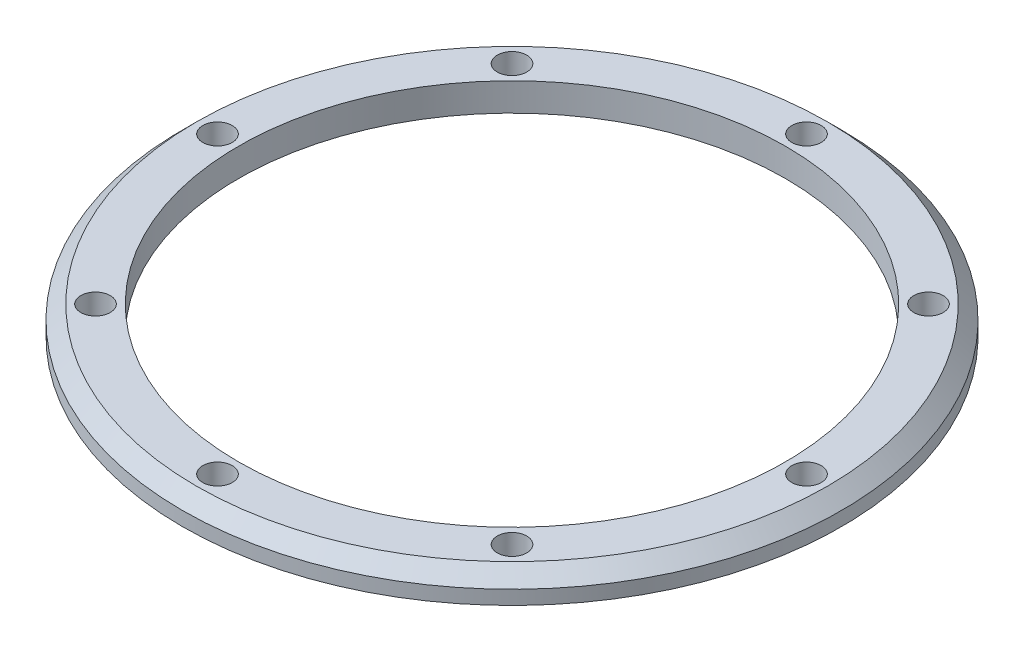
ISO-10303-21;
HEADER;
FILE_DESCRIPTION(('STEP AP214'),'2;1');
FILE_NAME('part.step','',(''),(''),'','','');
FILE_SCHEMA(('AUTOMOTIVE_DESIGN { 1 0 10303 214 1 1 1 1 }'));
ENDSEC;
DATA;
#1=APPLICATION_CONTEXT('core data for automotive mechanical design processes');
#2=APPLICATION_PROTOCOL_DEFINITION('international standard','automotive_design',2000,#1);
#3=PRODUCT_CONTEXT('',#1,'mechanical');
#4=PRODUCT('Part','Part','',(#3));
#5=PRODUCT_RELATED_PRODUCT_CATEGORY('part','',(#4));
#6=PRODUCT_DEFINITION_FORMATION('','',#4);
#7=PRODUCT_DEFINITION_CONTEXT('part definition',#1,'design');
#8=PRODUCT_DEFINITION('design','',#6,#7);
#9=PRODUCT_DEFINITION_SHAPE('','',#8);
#10=(LENGTH_UNIT() NAMED_UNIT(*) SI_UNIT(.MILLI.,.METRE.));
#11=(NAMED_UNIT(*) PLANE_ANGLE_UNIT() SI_UNIT($,.RADIAN.));
#12=(NAMED_UNIT(*) SI_UNIT($,.STERADIAN.) SOLID_ANGLE_UNIT());
#13=UNCERTAINTY_MEASURE_WITH_UNIT(LENGTH_MEASURE(1.E-05),#10,'distance_accuracy_value','');
#14=(GEOMETRIC_REPRESENTATION_CONTEXT(3) GLOBAL_UNCERTAINTY_ASSIGNED_CONTEXT((#13)) GLOBAL_UNIT_ASSIGNED_CONTEXT((#10,
#11,#12)) REPRESENTATION_CONTEXT('',''));
#15=CARTESIAN_POINT('',(0.,0.,0.));
#16=DIRECTION('',(0.,0.,1.));
#17=DIRECTION('',(1.,0.,0.));
#18=AXIS2_PLACEMENT_3D('',#15,#16,#17);
#19=CARTESIAN_POINT('',(0.,4.,0.));
#20=DIRECTION('',(0.,1.,0.));
#21=DIRECTION('',(0.,0.,1.));
#22=AXIS2_PLACEMENT_3D('',#19,#20,#21);
#23=PLANE('',#22);
#24=CARTESIAN_POINT('',(0.,4.,42.));
#25=DIRECTION('',(0.,1.,0.));
#26=DIRECTION('',(0.,0.,1.));
#27=AXIS2_PLACEMENT_3D('',#24,#25,#26);
#28=CIRCLE('',#27,2.1);
#29=CARTESIAN_POINT('',(0.,4.,44.1));
#30=VERTEX_POINT('',#29);
#31=EDGE_CURVE('E56',#30,#30,#28,.T.);
#32=ORIENTED_EDGE('',*,*,#31,.F.);
#33=EDGE_LOOP('',(#32));
#34=FACE_BOUND('',#33,.T.);
#35=CARTESIAN_POINT('',(29.698484809835,4.,29.698484809835));
#36=DIRECTION('',(0.,1.,0.));
#37=DIRECTION('',(0.,0.,1.));
#38=AXIS2_PLACEMENT_3D('',#35,#36,#37);
#39=CIRCLE('',#38,2.10000000000006);
#40=CARTESIAN_POINT('',(29.698484809835,4.,31.7984848098351));
#41=VERTEX_POINT('',#40);
#42=EDGE_CURVE('E59',#41,#41,#39,.T.);
#43=ORIENTED_EDGE('',*,*,#42,.F.);
#44=EDGE_LOOP('',(#43));
#45=FACE_BOUND('',#44,.T.);
#46=CARTESIAN_POINT('',(42.,4.,0.));
#47=DIRECTION('',(0.,1.,0.));
#48=DIRECTION('',(0.,0.,1.));
#49=AXIS2_PLACEMENT_3D('',#46,#47,#48);
#50=CIRCLE('',#49,2.10000000000014);
#51=CARTESIAN_POINT('',(42.,4.,2.10000000000014));
#52=VERTEX_POINT('',#51);
#53=EDGE_CURVE('E62',#52,#52,#50,.T.);
#54=ORIENTED_EDGE('',*,*,#53,.F.);
#55=EDGE_LOOP('',(#54));
#56=FACE_BOUND('',#55,.T.);
#57=CARTESIAN_POINT('',(29.698484809835,4.,-29.698484809835));
#58=DIRECTION('',(0.,1.,0.));
#59=DIRECTION('',(0.,0.,1.));
#60=AXIS2_PLACEMENT_3D('',#57,#58,#59);
#61=CIRCLE('',#60,2.10000000000022);
#62=CARTESIAN_POINT('',(29.698484809835,4.,-27.5984848098348));
#63=VERTEX_POINT('',#62);
#64=EDGE_CURVE('E65',#63,#63,#61,.T.);
#65=ORIENTED_EDGE('',*,*,#64,.F.);
#66=EDGE_LOOP('',(#65));
#67=FACE_BOUND('',#66,.T.);
#68=CARTESIAN_POINT('',(0.,4.,-42.));
#69=DIRECTION('',(0.,1.,0.));
#70=DIRECTION('',(0.,0.,1.));
#71=AXIS2_PLACEMENT_3D('',#68,#69,#70);
#72=CIRCLE('',#71,2.10000000000028);
#73=CARTESIAN_POINT('',(0.,4.,-39.8999999999997));
#74=VERTEX_POINT('',#73);
#75=EDGE_CURVE('E68',#74,#74,#72,.T.);
#76=ORIENTED_EDGE('',*,*,#75,.F.);
#77=EDGE_LOOP('',(#76));
#78=FACE_BOUND('',#77,.T.);
#79=CARTESIAN_POINT('',(-29.698484809835,4.,-29.698484809835));
#80=DIRECTION('',(0.,1.,0.));
#81=DIRECTION('',(0.,0.,1.));
#82=AXIS2_PLACEMENT_3D('',#79,#80,#81);
#83=CIRCLE('',#82,2.10000000000037);
#84=CARTESIAN_POINT('',(-29.698484809835,4.,-27.5984848098346));
#85=VERTEX_POINT('',#84);
#86=EDGE_CURVE('E71',#85,#85,#83,.T.);
#87=ORIENTED_EDGE('',*,*,#86,.F.);
#88=EDGE_LOOP('',(#87));
#89=FACE_BOUND('',#88,.T.);
#90=CARTESIAN_POINT('',(-42.,4.,0.));
#91=DIRECTION('',(0.,1.,0.));
#92=DIRECTION('',(0.,0.,1.));
#93=AXIS2_PLACEMENT_3D('',#90,#91,#92);
#94=CIRCLE('',#93,2.10000000000043);
#95=CARTESIAN_POINT('',(-42.,4.,2.10000000000042));
#96=VERTEX_POINT('',#95);
#97=EDGE_CURVE('E74',#96,#96,#94,.T.);
#98=ORIENTED_EDGE('',*,*,#97,.F.);
#99=EDGE_LOOP('',(#98));
#100=FACE_BOUND('',#99,.T.);
#101=CARTESIAN_POINT('',(-29.698484809835,4.,29.698484809835));
#102=DIRECTION('',(0.,1.,0.));
#103=DIRECTION('',(0.,0.,1.));
#104=AXIS2_PLACEMENT_3D('',#101,#102,#103);
#105=CIRCLE('',#104,2.1000000000005);
#106=CARTESIAN_POINT('',(-29.698484809835,4.,31.7984848098355));
#107=VERTEX_POINT('',#106);
#108=EDGE_CURVE('E77',#107,#107,#105,.T.);
#109=ORIENTED_EDGE('',*,*,#108,.F.);
#110=EDGE_LOOP('',(#109));
#111=FACE_BOUND('',#110,.T.);
#112=CARTESIAN_POINT('',(0.,4.,0.));
#113=DIRECTION('',(0.,-1.,0.));
#114=DIRECTION('',(0.,0.,-1.));
#115=AXIS2_PLACEMENT_3D('',#112,#113,#114);
#116=CIRCLE('',#115,39.);
#117=CARTESIAN_POINT('',(0.,4.,-39.));
#118=VERTEX_POINT('',#117);
#119=EDGE_CURVE('E53',#118,#118,#116,.T.);
#120=ORIENTED_EDGE('',*,*,#119,.T.);
#121=EDGE_LOOP('',(#120));
#122=FACE_BOUND('',#121,.T.);
#123=CARTESIAN_POINT('',(0.,4.,0.));
#124=DIRECTION('',(0.,-1.,0.));
#125=DIRECTION('',(0.,0.,-1.));
#126=AXIS2_PLACEMENT_3D('',#123,#124,#125);
#127=CIRCLE('',#126,45.);
#128=CARTESIAN_POINT('',(0.,4.,-45.));
#129=VERTEX_POINT('',#128);
#130=EDGE_CURVE('E10',#129,#129,#127,.T.);
#131=ORIENTED_EDGE('',*,*,#130,.F.);
#132=EDGE_LOOP('',(#131));
#133=FACE_BOUND('',#132,.T.);
#134=ADVANCED_FACE('F34',(#34,#45,#56,#67,#78,#89,#100,#111,#122,#133),#23,.T.);
#135=CARTESIAN_POINT('',(0.,4.,0.));
#136=DIRECTION('',(0.,-1.,0.));
#137=DIRECTION('',(0.,0.,-1.));
#138=AXIS2_PLACEMENT_3D('',#135,#136,#137);
#139=CONICAL_SURFACE('',#138,45.,0.785398163397443);
#140=CARTESIAN_POINT('',(0.,1.99999999999998,0.));
#141=DIRECTION('',(0.,-1.,0.));
#142=DIRECTION('',(0.,0.,-1.));
#143=AXIS2_PLACEMENT_3D('',#140,#141,#142);
#144=CIRCLE('',#143,47.);
#145=CARTESIAN_POINT('',(0.,1.99999999999998,-47.));
#146=VERTEX_POINT('',#145);
#147=EDGE_CURVE('E40',#146,#146,#144,.T.);
#148=ORIENTED_EDGE('',*,*,#147,.F.);
#149=EDGE_LOOP('',(#148));
#150=FACE_BOUND('',#149,.T.);
#151=ORIENTED_EDGE('',*,*,#130,.T.);
#152=EDGE_LOOP('',(#151));
#153=FACE_BOUND('',#152,.T.);
#154=ADVANCED_FACE('F139',(#150,#153),#139,.T.);
#155=CARTESIAN_POINT('',(0.,0.,0.));
#156=DIRECTION('',(0.,-1.,0.));
#157=DIRECTION('',(0.,0.,-1.));
#158=AXIS2_PLACEMENT_3D('',#155,#156,#157);
#159=CYLINDRICAL_SURFACE('',#158,47.);
#160=ORIENTED_EDGE('',*,*,#147,.T.);
#161=EDGE_LOOP('',(#160));
#162=FACE_BOUND('',#161,.T.);
#163=CARTESIAN_POINT('',(0.,0.,0.));
#164=DIRECTION('',(0.,-1.,0.));
#165=DIRECTION('',(0.,0.,-1.));
#166=AXIS2_PLACEMENT_3D('',#163,#164,#165);
#167=CIRCLE('',#166,47.);
#168=CARTESIAN_POINT('',(0.,0.,-47.));
#169=VERTEX_POINT('',#168);
#170=EDGE_CURVE('E44',#169,#169,#167,.T.);
#171=ORIENTED_EDGE('',*,*,#170,.F.);
#172=EDGE_LOOP('',(#171));
#173=FACE_BOUND('',#172,.T.);
#174=ADVANCED_FACE('F111',(#162,#173),#159,.T.);
#175=CARTESIAN_POINT('',(0.,0.,0.));
#176=DIRECTION('',(0.,-1.,0.));
#177=DIRECTION('',(0.,0.,-1.));
#178=AXIS2_PLACEMENT_3D('',#175,#176,#177);
#179=PLANE('',#178);
#180=CARTESIAN_POINT('',(0.,0.,42.));
#181=DIRECTION('',(0.,-1.,0.));
#182=DIRECTION('',(0.,0.,-1.));
#183=AXIS2_PLACEMENT_3D('',#180,#181,#182);
#184=CIRCLE('',#183,2.1);
#185=CARTESIAN_POINT('',(0.,0.,39.9));
#186=VERTEX_POINT('',#185);
#187=EDGE_CURVE('E80',#186,#186,#184,.T.);
#188=ORIENTED_EDGE('',*,*,#187,.F.);
#189=EDGE_LOOP('',(#188));
#190=FACE_BOUND('',#189,.T.);
#191=CARTESIAN_POINT('',(29.698484809835,0.,29.698484809835));
#192=DIRECTION('',(0.,-1.,0.));
#193=DIRECTION('',(0.,0.,-1.));
#194=AXIS2_PLACEMENT_3D('',#191,#192,#193);
#195=CIRCLE('',#194,2.10000000000006);
#196=CARTESIAN_POINT('',(29.698484809835,0.,27.5984848098349));
#197=VERTEX_POINT('',#196);
#198=EDGE_CURVE('E99',#197,#197,#195,.T.);
#199=ORIENTED_EDGE('',*,*,#198,.F.);
#200=EDGE_LOOP('',(#199));
#201=FACE_BOUND('',#200,.T.);
#202=CARTESIAN_POINT('',(42.,0.,0.));
#203=DIRECTION('',(0.,-1.,0.));
#204=DIRECTION('',(0.,0.,-1.));
#205=AXIS2_PLACEMENT_3D('',#202,#203,#204);
#206=CIRCLE('',#205,2.10000000000014);
#207=CARTESIAN_POINT('',(42.,0.,-2.10000000000014));
#208=VERTEX_POINT('',#207);
#209=EDGE_CURVE('E96',#208,#208,#206,.T.);
#210=ORIENTED_EDGE('',*,*,#209,.F.);
#211=EDGE_LOOP('',(#210));
#212=FACE_BOUND('',#211,.T.);
#213=CARTESIAN_POINT('',(29.698484809835,0.,-29.698484809835));
#214=DIRECTION('',(0.,-1.,0.));
#215=DIRECTION('',(0.,0.,-1.));
#216=AXIS2_PLACEMENT_3D('',#213,#214,#215);
#217=CIRCLE('',#216,2.10000000000022);
#218=CARTESIAN_POINT('',(29.698484809835,0.,-31.7984848098352));
#219=VERTEX_POINT('',#218);
#220=EDGE_CURVE('E93',#219,#219,#217,.T.);
#221=ORIENTED_EDGE('',*,*,#220,.F.);
#222=EDGE_LOOP('',(#221));
#223=FACE_BOUND('',#222,.T.);
#224=CARTESIAN_POINT('',(0.,0.,-42.));
#225=DIRECTION('',(0.,-1.,0.));
#226=DIRECTION('',(0.,0.,-1.));
#227=AXIS2_PLACEMENT_3D('',#224,#225,#226);
#228=CIRCLE('',#227,2.10000000000028);
#229=CARTESIAN_POINT('',(0.,0.,-44.1000000000003));
#230=VERTEX_POINT('',#229);
#231=EDGE_CURVE('E90',#230,#230,#228,.T.);
#232=ORIENTED_EDGE('',*,*,#231,.F.);
#233=EDGE_LOOP('',(#232));
#234=FACE_BOUND('',#233,.T.);
#235=CARTESIAN_POINT('',(-29.698484809835,0.,-29.698484809835));
#236=DIRECTION('',(0.,-1.,0.));
#237=DIRECTION('',(0.,0.,-1.));
#238=AXIS2_PLACEMENT_3D('',#235,#236,#237);
#239=CIRCLE('',#238,2.10000000000037);
#240=CARTESIAN_POINT('',(-29.698484809835,0.,-31.7984848098354));
#241=VERTEX_POINT('',#240);
#242=EDGE_CURVE('E87',#241,#241,#239,.T.);
#243=ORIENTED_EDGE('',*,*,#242,.F.);
#244=EDGE_LOOP('',(#243));
#245=FACE_BOUND('',#244,.T.);
#246=CARTESIAN_POINT('',(-42.,0.,0.));
#247=DIRECTION('',(0.,-1.,0.));
#248=DIRECTION('',(0.,0.,-1.));
#249=AXIS2_PLACEMENT_3D('',#246,#247,#248);
#250=CIRCLE('',#249,2.10000000000043);
#251=CARTESIAN_POINT('',(-42.,0.,-2.10000000000043));
#252=VERTEX_POINT('',#251);
#253=EDGE_CURVE('E84',#252,#252,#250,.T.);
#254=ORIENTED_EDGE('',*,*,#253,.F.);
#255=EDGE_LOOP('',(#254));
#256=FACE_BOUND('',#255,.T.);
#257=CARTESIAN_POINT('',(-29.698484809835,0.,29.698484809835));
#258=DIRECTION('',(0.,-1.,0.));
#259=DIRECTION('',(0.,0.,-1.));
#260=AXIS2_PLACEMENT_3D('',#257,#258,#259);
#261=CIRCLE('',#260,2.1000000000005);
#262=CARTESIAN_POINT('',(-29.698484809835,0.,27.5984848098345));
#263=VERTEX_POINT('',#262);
#264=EDGE_CURVE('E81',#263,#263,#261,.T.);
#265=ORIENTED_EDGE('',*,*,#264,.F.);
#266=EDGE_LOOP('',(#265));
#267=FACE_BOUND('',#266,.T.);
#268=ORIENTED_EDGE('',*,*,#170,.T.);
#269=EDGE_LOOP('',(#268));
#270=FACE_BOUND('',#269,.T.);
#271=CARTESIAN_POINT('',(0.,0.,0.));
#272=DIRECTION('',(0.,-1.,0.));
#273=DIRECTION('',(0.,0.,-1.));
#274=AXIS2_PLACEMENT_3D('',#271,#272,#273);
#275=CIRCLE('',#274,39.);
#276=CARTESIAN_POINT('',(0.,0.,-39.));
#277=VERTEX_POINT('',#276);
#278=EDGE_CURVE('E48',#277,#277,#275,.T.);
#279=ORIENTED_EDGE('',*,*,#278,.F.);
#280=EDGE_LOOP('',(#279));
#281=FACE_BOUND('',#280,.T.);
#282=ADVANCED_FACE('F107',(#190,#201,#212,#223,#234,#245,#256,#267,#270,#281),#179,.T.);
#283=CARTESIAN_POINT('',(0.,0.,0.));
#284=DIRECTION('',(0.,-1.,0.));
#285=DIRECTION('',(0.,0.,-1.));
#286=AXIS2_PLACEMENT_3D('',#283,#284,#285);
#287=CYLINDRICAL_SURFACE('',#286,39.);
#288=ORIENTED_EDGE('',*,*,#278,.T.);
#289=EDGE_LOOP('',(#288));
#290=FACE_BOUND('',#289,.T.);
#291=ORIENTED_EDGE('',*,*,#119,.F.);
#292=EDGE_LOOP('',(#291));
#293=FACE_BOUND('',#292,.T.);
#294=ADVANCED_FACE('F110',(#290,#293),#287,.F.);
#295=CARTESIAN_POINT('',(-29.698484809835,10.,29.698484809835));
#296=DIRECTION('',(0.,-1.,0.));
#297=DIRECTION('',(0.,0.,-1.));
#298=AXIS2_PLACEMENT_3D('',#295,#296,#297);
#299=CYLINDRICAL_SURFACE('',#298,2.1000000000005);
#300=ORIENTED_EDGE('',*,*,#108,.T.);
#301=EDGE_LOOP('',(#300));
#302=FACE_BOUND('',#301,.T.);
#303=ORIENTED_EDGE('',*,*,#264,.T.);
#304=EDGE_LOOP('',(#303));
#305=FACE_BOUND('',#304,.T.);
#306=ADVANCED_FACE('F133',(#302,#305),#299,.F.);
#307=CARTESIAN_POINT('',(-42.,10.,0.));
#308=DIRECTION('',(0.,-1.,0.));
#309=DIRECTION('',(0.,0.,-1.));
#310=AXIS2_PLACEMENT_3D('',#307,#308,#309);
#311=CYLINDRICAL_SURFACE('',#310,2.10000000000043);
#312=ORIENTED_EDGE('',*,*,#97,.T.);
#313=EDGE_LOOP('',(#312));
#314=FACE_BOUND('',#313,.T.);
#315=ORIENTED_EDGE('',*,*,#253,.T.);
#316=EDGE_LOOP('',(#315));
#317=FACE_BOUND('',#316,.T.);
#318=ADVANCED_FACE('F163',(#314,#317),#311,.F.);
#319=CARTESIAN_POINT('',(-29.698484809835,10.,-29.698484809835));
#320=DIRECTION('',(0.,-1.,0.));
#321=DIRECTION('',(0.,0.,-1.));
#322=AXIS2_PLACEMENT_3D('',#319,#320,#321);
#323=CYLINDRICAL_SURFACE('',#322,2.10000000000037);
#324=ORIENTED_EDGE('',*,*,#86,.T.);
#325=EDGE_LOOP('',(#324));
#326=FACE_BOUND('',#325,.T.);
#327=ORIENTED_EDGE('',*,*,#242,.T.);
#328=EDGE_LOOP('',(#327));
#329=FACE_BOUND('',#328,.T.);
#330=ADVANCED_FACE('F168',(#326,#329),#323,.F.);
#331=CARTESIAN_POINT('',(0.,10.,-42.));
#332=DIRECTION('',(0.,-1.,0.));
#333=DIRECTION('',(0.,0.,-1.));
#334=AXIS2_PLACEMENT_3D('',#331,#332,#333);
#335=CYLINDRICAL_SURFACE('',#334,2.10000000000028);
#336=ORIENTED_EDGE('',*,*,#75,.T.);
#337=EDGE_LOOP('',(#336));
#338=FACE_BOUND('',#337,.T.);
#339=ORIENTED_EDGE('',*,*,#231,.T.);
#340=EDGE_LOOP('',(#339));
#341=FACE_BOUND('',#340,.T.);
#342=ADVANCED_FACE('F218',(#338,#341),#335,.F.);
#343=CARTESIAN_POINT('',(29.698484809835,10.,-29.698484809835));
#344=DIRECTION('',(0.,-1.,0.));
#345=DIRECTION('',(0.,0.,-1.));
#346=AXIS2_PLACEMENT_3D('',#343,#344,#345);
#347=CYLINDRICAL_SURFACE('',#346,2.10000000000022);
#348=ORIENTED_EDGE('',*,*,#64,.T.);
#349=EDGE_LOOP('',(#348));
#350=FACE_BOUND('',#349,.T.);
#351=ORIENTED_EDGE('',*,*,#220,.T.);
#352=EDGE_LOOP('',(#351));
#353=FACE_BOUND('',#352,.T.);
#354=ADVANCED_FACE('F226',(#350,#353),#347,.F.);
#355=CARTESIAN_POINT('',(42.,10.,0.));
#356=DIRECTION('',(0.,-1.,0.));
#357=DIRECTION('',(0.,0.,-1.));
#358=AXIS2_PLACEMENT_3D('',#355,#356,#357);
#359=CYLINDRICAL_SURFACE('',#358,2.10000000000014);
#360=ORIENTED_EDGE('',*,*,#53,.T.);
#361=EDGE_LOOP('',(#360));
#362=FACE_BOUND('',#361,.T.);
#363=ORIENTED_EDGE('',*,*,#209,.T.);
#364=EDGE_LOOP('',(#363));
#365=FACE_BOUND('',#364,.T.);
#366=ADVANCED_FACE('F235',(#362,#365),#359,.F.);
#367=CARTESIAN_POINT('',(29.698484809835,10.,29.698484809835));
#368=DIRECTION('',(0.,-1.,0.));
#369=DIRECTION('',(0.,0.,-1.));
#370=AXIS2_PLACEMENT_3D('',#367,#368,#369);
#371=CYLINDRICAL_SURFACE('',#370,2.10000000000006);
#372=ORIENTED_EDGE('',*,*,#42,.T.);
#373=EDGE_LOOP('',(#372));
#374=FACE_BOUND('',#373,.T.);
#375=ORIENTED_EDGE('',*,*,#198,.T.);
#376=EDGE_LOOP('',(#375));
#377=FACE_BOUND('',#376,.T.);
#378=ADVANCED_FACE('F244',(#374,#377),#371,.F.);
#379=CARTESIAN_POINT('',(0.,10.,42.));
#380=DIRECTION('',(0.,-1.,0.));
#381=DIRECTION('',(0.,0.,-1.));
#382=AXIS2_PLACEMENT_3D('',#379,#380,#381);
#383=CYLINDRICAL_SURFACE('',#382,2.1);
#384=ORIENTED_EDGE('',*,*,#31,.T.);
#385=EDGE_LOOP('',(#384));
#386=FACE_BOUND('',#385,.T.);
#387=ORIENTED_EDGE('',*,*,#187,.T.);
#388=EDGE_LOOP('',(#387));
#389=FACE_BOUND('',#388,.T.);
#390=ADVANCED_FACE('F105',(#386,#389),#383,.F.);
#391=CLOSED_SHELL('',(#134,#154,#174,#282,#294,#306,#318,#330,#342,#354,#366,#378,#390));
#392=MANIFOLD_SOLID_BREP('B2',#391);
#393=ADVANCED_BREP_SHAPE_REPRESENTATION('',(#18,#392),#14);
#394=SHAPE_DEFINITION_REPRESENTATION(#9,#393);
ENDSEC;
END-ISO-10303-21;
